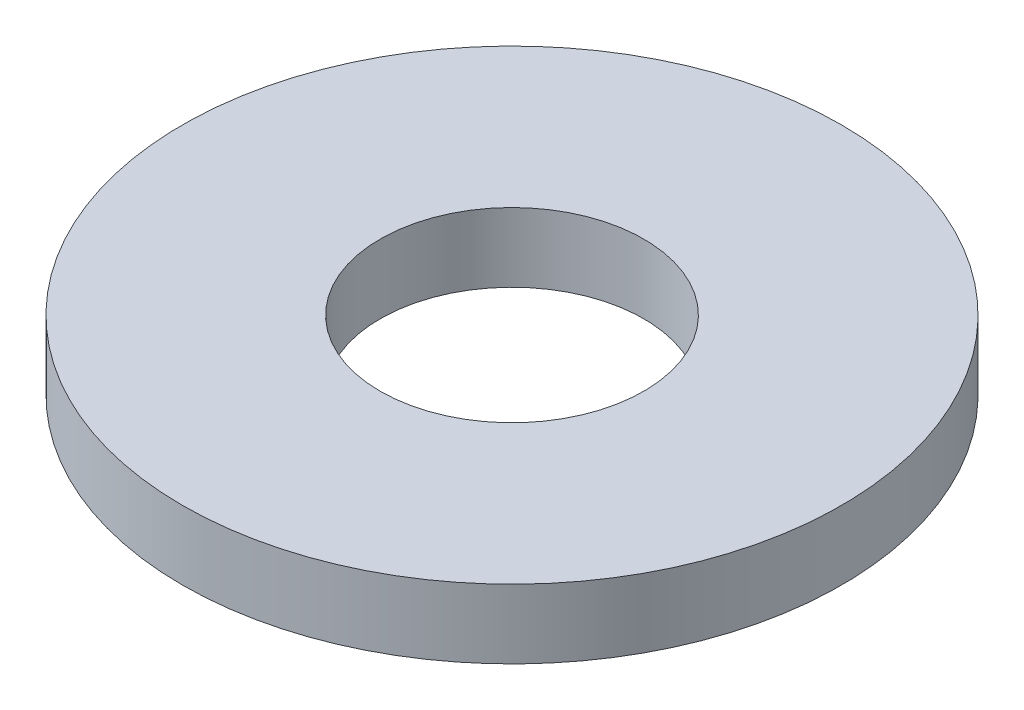
ISO-10303-21;
HEADER;
FILE_DESCRIPTION(('STEP AP214'),'2;1');
FILE_NAME('part.step','',(''),(''),'','','');
FILE_SCHEMA(('AUTOMOTIVE_DESIGN { 1 0 10303 214 1 1 1 1 }'));
ENDSEC;
DATA;
#1=APPLICATION_CONTEXT('core data for automotive mechanical design processes');
#2=APPLICATION_PROTOCOL_DEFINITION('international standard','automotive_design',2000,#1);
#3=PRODUCT_CONTEXT('',#1,'mechanical');
#4=PRODUCT('Part','Part','',(#3));
#5=PRODUCT_RELATED_PRODUCT_CATEGORY('part','',(#4));
#6=PRODUCT_DEFINITION_FORMATION('','',#4);
#7=PRODUCT_DEFINITION_CONTEXT('part definition',#1,'design');
#8=PRODUCT_DEFINITION('design','',#6,#7);
#9=PRODUCT_DEFINITION_SHAPE('','',#8);
#10=(LENGTH_UNIT() NAMED_UNIT(*) SI_UNIT(.MILLI.,.METRE.));
#11=(NAMED_UNIT(*) PLANE_ANGLE_UNIT() SI_UNIT($,.RADIAN.));
#12=(NAMED_UNIT(*) SI_UNIT($,.STERADIAN.) SOLID_ANGLE_UNIT());
#13=UNCERTAINTY_MEASURE_WITH_UNIT(LENGTH_MEASURE(1.E-05),#10,'distance_accuracy_value','');
#14=(GEOMETRIC_REPRESENTATION_CONTEXT(3) GLOBAL_UNCERTAINTY_ASSIGNED_CONTEXT((#13)) GLOBAL_UNIT_ASSIGNED_CONTEXT((#10,
#11,#12)) REPRESENTATION_CONTEXT('',''));
#15=CARTESIAN_POINT('',(0.,0.,0.));
#16=DIRECTION('',(0.,0.,1.));
#17=DIRECTION('',(1.,0.,0.));
#18=AXIS2_PLACEMENT_3D('',#15,#16,#17);
#19=CARTESIAN_POINT('',(0.,0.8382,0.));
#20=DIRECTION('',(0.,-1.,0.));
#21=DIRECTION('',(0.,0.,-1.));
#22=AXIS2_PLACEMENT_3D('',#19,#20,#21);
#23=CYLINDRICAL_SURFACE('',#22,4.0005);
#24=CARTESIAN_POINT('',(0.,0.8382,0.));
#25=DIRECTION('',(0.,1.,0.));
#26=DIRECTION('',(0.,0.,1.));
#27=AXIS2_PLACEMENT_3D('',#24,#25,#26);
#28=CIRCLE('',#27,4.0005);
#29=CARTESIAN_POINT('',(0.,0.8382,4.0005));
#30=VERTEX_POINT('',#29);
#31=EDGE_CURVE('E10',#30,#30,#28,.T.);
#32=ORIENTED_EDGE('',*,*,#31,.F.);
#33=EDGE_LOOP('',(#32));
#34=FACE_BOUND('',#33,.T.);
#35=CARTESIAN_POINT('',(0.,0.,0.));
#36=DIRECTION('',(0.,1.,0.));
#37=DIRECTION('',(0.,0.,1.));
#38=AXIS2_PLACEMENT_3D('',#35,#36,#37);
#39=CIRCLE('',#38,4.0005);
#40=CARTESIAN_POINT('',(0.,0.,4.0005));
#41=VERTEX_POINT('',#40);
#42=EDGE_CURVE('E33',#41,#41,#39,.T.);
#43=ORIENTED_EDGE('',*,*,#42,.T.);
#44=EDGE_LOOP('',(#43));
#45=FACE_BOUND('',#44,.T.);
#46=ADVANCED_FACE('F30',(#34,#45),#23,.T.);
#47=CARTESIAN_POINT('',(0.,0.8382,0.));
#48=DIRECTION('',(0.,1.,0.));
#49=DIRECTION('',(0.,0.,1.));
#50=AXIS2_PLACEMENT_3D('',#47,#48,#49);
#51=PLANE('',#50);
#52=CARTESIAN_POINT('',(0.,0.8382,0.));
#53=DIRECTION('',(0.,1.,0.));
#54=DIRECTION('',(0.,0.,1.));
#55=AXIS2_PLACEMENT_3D('',#52,#53,#54);
#56=CIRCLE('',#55,1.6002);
#57=CARTESIAN_POINT('',(0.,0.8382,1.6002));
#58=VERTEX_POINT('',#57);
#59=EDGE_CURVE('E42',#58,#58,#56,.T.);
#60=ORIENTED_EDGE('',*,*,#59,.F.);
#61=EDGE_LOOP('',(#60));
#62=FACE_BOUND('',#61,.T.);
#63=ORIENTED_EDGE('',*,*,#31,.T.);
#64=EDGE_LOOP('',(#63));
#65=FACE_BOUND('',#64,.T.);
#66=ADVANCED_FACE('F57',(#62,#65),#51,.T.);
#67=CARTESIAN_POINT('',(0.,0.,0.));
#68=DIRECTION('',(0.,1.,0.));
#69=DIRECTION('',(0.,0.,1.));
#70=AXIS2_PLACEMENT_3D('',#67,#68,#69);
#71=PLANE('',#70);
#72=CARTESIAN_POINT('',(0.,0.,0.));
#73=DIRECTION('',(0.,1.,0.));
#74=DIRECTION('',(0.,0.,1.));
#75=AXIS2_PLACEMENT_3D('',#72,#73,#74);
#76=CIRCLE('',#75,1.6002);
#77=CARTESIAN_POINT('',(0.,0.,1.6002));
#78=VERTEX_POINT('',#77);
#79=EDGE_CURVE('E40',#78,#78,#76,.T.);
#80=ORIENTED_EDGE('',*,*,#79,.T.);
#81=EDGE_LOOP('',(#80));
#82=FACE_BOUND('',#81,.T.);
#83=ORIENTED_EDGE('',*,*,#42,.F.);
#84=EDGE_LOOP('',(#83));
#85=FACE_BOUND('',#84,.T.);
#86=ADVANCED_FACE('F48',(#82,#85),#71,.F.);
#87=CARTESIAN_POINT('',(0.,0.,0.));
#88=DIRECTION('',(0.,1.,0.));
#89=DIRECTION('',(0.,0.,1.));
#90=AXIS2_PLACEMENT_3D('',#87,#88,#89);
#91=CYLINDRICAL_SURFACE('',#90,1.6002);
#92=ORIENTED_EDGE('',*,*,#79,.F.);
#93=EDGE_LOOP('',(#92));
#94=FACE_BOUND('',#93,.T.);
#95=ORIENTED_EDGE('',*,*,#59,.T.);
#96=EDGE_LOOP('',(#95));
#97=FACE_BOUND('',#96,.T.);
#98=ADVANCED_FACE('F51',(#94,#97),#91,.F.);
#99=CLOSED_SHELL('',(#46,#66,#86,#98));
#100=MANIFOLD_SOLID_BREP('B2',#99);
#101=ADVANCED_BREP_SHAPE_REPRESENTATION('',(#18,#100),#14);
#102=SHAPE_DEFINITION_REPRESENTATION(#9,#101);
ENDSEC;
END-ISO-10303-21;
